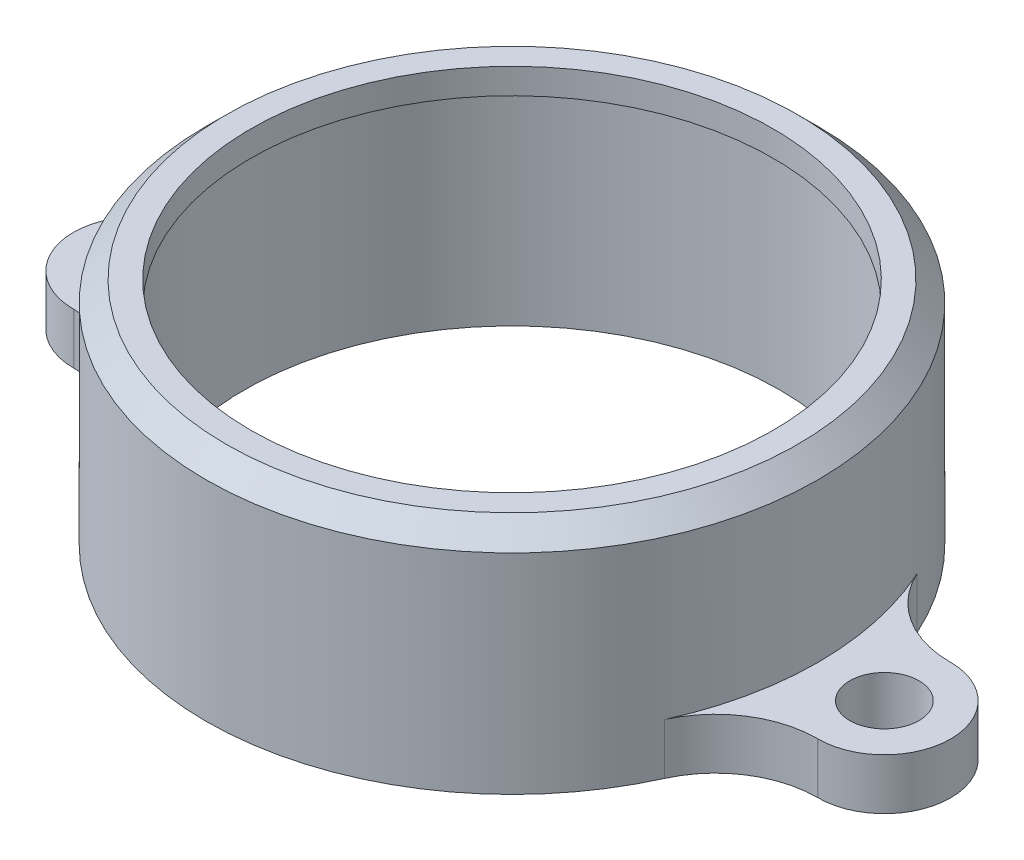
ISO-10303-21;
HEADER;
FILE_DESCRIPTION(('STEP AP214'),'2;1');
FILE_NAME('part.step','',(''),(''),'','','');
FILE_SCHEMA(('AUTOMOTIVE_DESIGN { 1 0 10303 214 1 1 1 1 }'));
ENDSEC;
DATA;
#1=APPLICATION_CONTEXT('core data for automotive mechanical design processes');
#2=APPLICATION_PROTOCOL_DEFINITION('international standard','automotive_design',2000,#1);
#3=PRODUCT_CONTEXT('',#1,'mechanical');
#4=PRODUCT('Part','Part','',(#3));
#5=PRODUCT_RELATED_PRODUCT_CATEGORY('part','',(#4));
#6=PRODUCT_DEFINITION_FORMATION('','',#4);
#7=PRODUCT_DEFINITION_CONTEXT('part definition',#1,'design');
#8=PRODUCT_DEFINITION('design','',#6,#7);
#9=PRODUCT_DEFINITION_SHAPE('','',#8);
#10=(LENGTH_UNIT() NAMED_UNIT(*) SI_UNIT(.MILLI.,.METRE.));
#11=(NAMED_UNIT(*) PLANE_ANGLE_UNIT() SI_UNIT($,.RADIAN.));
#12=(NAMED_UNIT(*) SI_UNIT($,.STERADIAN.) SOLID_ANGLE_UNIT());
#13=UNCERTAINTY_MEASURE_WITH_UNIT(LENGTH_MEASURE(1.E-05),#10,'distance_accuracy_value','');
#14=(GEOMETRIC_REPRESENTATION_CONTEXT(3) GLOBAL_UNCERTAINTY_ASSIGNED_CONTEXT((#13)) GLOBAL_UNIT_ASSIGNED_CONTEXT((#10,
#11,#12)) REPRESENTATION_CONTEXT('',''));
#15=CARTESIAN_POINT('',(0.,0.,0.));
#16=DIRECTION('',(0.,0.,1.));
#17=DIRECTION('',(1.,0.,0.));
#18=AXIS2_PLACEMENT_3D('',#15,#16,#17);
#19=CARTESIAN_POINT('',(0.,-1.5875,0.));
#20=DIRECTION('',(0.,1.,0.));
#21=DIRECTION('',(0.,0.,1.));
#22=AXIS2_PLACEMENT_3D('',#19,#20,#21);
#23=PLANE('',#22);
#24=CARTESIAN_POINT('',(0.,-1.5875,0.));
#25=DIRECTION('',(0.,1.,0.));
#26=DIRECTION('',(0.,0.,1.));
#27=AXIS2_PLACEMENT_3D('',#24,#25,#26);
#28=CIRCLE('',#27,16.256);
#29=CARTESIAN_POINT('',(0.,-1.5875,16.256));
#30=VERTEX_POINT('',#29);
#31=EDGE_CURVE('E213',#30,#30,#28,.T.);
#32=ORIENTED_EDGE('',*,*,#31,.T.);
#33=EDGE_LOOP('',(#32));
#34=FACE_BOUND('',#33,.T.);
#35=CARTESIAN_POINT('',(0.,-1.5875,0.));
#36=DIRECTION('',(0.,-1.,0.));
#37=DIRECTION('',(0.,0.,-1.));
#38=AXIS2_PLACEMENT_3D('',#35,#36,#37);
#39=CIRCLE('',#38,16.66875);
#40=CARTESIAN_POINT('',(0.,-1.5875,-16.66875));
#41=VERTEX_POINT('',#40);
#42=EDGE_CURVE('E155',#41,#41,#39,.T.);
#43=ORIENTED_EDGE('',*,*,#42,.T.);
#44=EDGE_LOOP('',(#43));
#45=FACE_BOUND('',#44,.T.);
#46=ADVANCED_FACE('F38',(#34,#45),#23,.F.);
#47=CARTESIAN_POINT('',(0.,-1.5875,0.));
#48=DIRECTION('',(0.,1.,0.));
#49=DIRECTION('',(0.,0.,1.));
#50=AXIS2_PLACEMENT_3D('',#47,#48,#49);
#51=CYLINDRICAL_SURFACE('',#50,19.05);
#52=CARTESIAN_POINT('',(0.,-1.27000000000001,0.));
#53=DIRECTION('',(0.,1.,0.));
#54=DIRECTION('',(0.,0.,1.));
#55=AXIS2_PLACEMENT_3D('',#52,#53,#54);
#56=CIRCLE('',#55,19.05);
#57=CARTESIAN_POINT('',(0.,-1.27000000000001,19.05));
#58=VERTEX_POINT('',#57);
#59=EDGE_CURVE('E224',#58,#58,#56,.F.);
#60=ORIENTED_EDGE('',*,*,#59,.T.);
#61=EDGE_LOOP('',(#60));
#62=FACE_BOUND('',#61,.T.);
#63=CARTESIAN_POINT('',(0.,-14.2875,0.));
#64=DIRECTION('',(0.,-1.,0.));
#65=DIRECTION('',(0.,0.,-1.));
#66=AXIS2_PLACEMENT_3D('',#63,#64,#65);
#67=CIRCLE('',#66,19.05);
#68=CARTESIAN_POINT('',(-17.3537422904795,-14.2875,-7.858125));
#69=VERTEX_POINT('',#68);
#70=CARTESIAN_POINT('',(17.3537422904795,-14.2875,-7.858125));
#71=VERTEX_POINT('',#70);
#72=EDGE_CURVE('E163',#69,#71,#67,.T.);
#73=ORIENTED_EDGE('',*,*,#72,.F.);
#74=DIRECTION('',(0.,1.,0.));
#75=VECTOR('',#74,1.);
#76=CARTESIAN_POINT('',(-17.3537422904795,-1.5875,-7.858125));
#77=LINE('',#76,#75);
#78=CARTESIAN_POINT('',(-17.3537422904795,-11.1125,-7.858125));
#79=VERTEX_POINT('',#78);
#80=EDGE_CURVE('E237',#69,#79,#77,.T.);
#81=ORIENTED_EDGE('',*,*,#80,.T.);
#82=CARTESIAN_POINT('',(0.,-11.1125,0.));
#83=DIRECTION('',(0.,-1.,0.));
#84=DIRECTION('',(0.,0.,-1.));
#85=AXIS2_PLACEMENT_3D('',#82,#83,#84);
#86=CIRCLE('',#85,19.05);
#87=CARTESIAN_POINT('',(-17.3537422904795,-11.1125,7.858125));
#88=VERTEX_POINT('',#87);
#89=EDGE_CURVE('E209',#88,#79,#86,.T.);
#90=ORIENTED_EDGE('',*,*,#89,.F.);
#91=DIRECTION('',(0.,1.,0.));
#92=VECTOR('',#91,1.);
#93=CARTESIAN_POINT('',(-17.3537422904795,-1.5875,7.858125));
#94=LINE('',#93,#92);
#95=CARTESIAN_POINT('',(-17.3537422904795,-14.2875,7.858125));
#96=VERTEX_POINT('',#95);
#97=EDGE_CURVE('E228',#88,#96,#94,.F.);
#98=ORIENTED_EDGE('',*,*,#97,.T.);
#99=CARTESIAN_POINT('',(0.,-14.2875,0.));
#100=DIRECTION('',(0.,-1.,0.));
#101=DIRECTION('',(0.,0.,-1.));
#102=AXIS2_PLACEMENT_3D('',#99,#100,#101);
#103=CIRCLE('',#102,19.05);
#104=CARTESIAN_POINT('',(17.3537422904795,-14.2875,7.858125));
#105=VERTEX_POINT('',#104);
#106=EDGE_CURVE('E146',#105,#96,#103,.T.);
#107=ORIENTED_EDGE('',*,*,#106,.F.);
#108=DIRECTION('',(0.,1.,0.));
#109=VECTOR('',#108,1.);
#110=CARTESIAN_POINT('',(17.3537422904795,-1.5875,7.858125));
#111=LINE('',#110,#109);
#112=CARTESIAN_POINT('',(17.3537422904795,-11.1125,7.858125));
#113=VERTEX_POINT('',#112);
#114=EDGE_CURVE('E230',#105,#113,#111,.T.);
#115=ORIENTED_EDGE('',*,*,#114,.T.);
#116=CARTESIAN_POINT('',(17.3537422904795,-11.1125,-7.858125));
#117=VERTEX_POINT('',#116);
#118=EDGE_CURVE('E205',#117,#113,#86,.T.);
#119=ORIENTED_EDGE('',*,*,#118,.F.);
#120=DIRECTION('',(0.,1.,0.));
#121=VECTOR('',#120,1.);
#122=CARTESIAN_POINT('',(17.3537422904795,-1.5875,-7.858125));
#123=LINE('',#122,#121);
#124=EDGE_CURVE('E234',#117,#71,#123,.F.);
#125=ORIENTED_EDGE('',*,*,#124,.T.);
#126=EDGE_LOOP('',(#73,#81,#90,#98,#107,#115,#119,#125));
#127=FACE_BOUND('',#126,.T.);
#128=ADVANCED_FACE('F273',(#62,#127),#51,.T.);
#129=CARTESIAN_POINT('',(0.,0.,0.));
#130=DIRECTION('',(0.,1.,0.));
#131=DIRECTION('',(0.,0.,1.));
#132=AXIS2_PLACEMENT_3D('',#129,#130,#131);
#133=PLANE('',#132);
#134=CARTESIAN_POINT('',(0.,0.,0.));
#135=DIRECTION('',(0.,1.,0.));
#136=DIRECTION('',(0.,0.,1.));
#137=AXIS2_PLACEMENT_3D('',#134,#135,#136);
#138=CIRCLE('',#137,17.78);
#139=CARTESIAN_POINT('',(0.,0.,17.78));
#140=VERTEX_POINT('',#139);
#141=EDGE_CURVE('E217',#140,#140,#138,.T.);
#142=ORIENTED_EDGE('',*,*,#141,.T.);
#143=EDGE_LOOP('',(#142));
#144=FACE_BOUND('',#143,.T.);
#145=CARTESIAN_POINT('',(0.,0.,0.));
#146=DIRECTION('',(0.,1.,0.));
#147=DIRECTION('',(0.,0.,1.));
#148=AXIS2_PLACEMENT_3D('',#145,#146,#147);
#149=CIRCLE('',#148,16.256);
#150=CARTESIAN_POINT('',(0.,0.,16.256));
#151=VERTEX_POINT('',#150);
#152=EDGE_CURVE('E208',#151,#151,#149,.T.);
#153=ORIENTED_EDGE('',*,*,#152,.F.);
#154=EDGE_LOOP('',(#153));
#155=FACE_BOUND('',#154,.T.);
#156=ADVANCED_FACE('F321',(#144,#155),#133,.T.);
#157=CARTESIAN_POINT('',(0.,-1.5875,0.));
#158=DIRECTION('',(0.,1.,0.));
#159=DIRECTION('',(0.,0.,1.));
#160=AXIS2_PLACEMENT_3D('',#157,#158,#159);
#161=CYLINDRICAL_SURFACE('',#160,16.256);
#162=ORIENTED_EDGE('',*,*,#31,.F.);
#163=EDGE_LOOP('',(#162));
#164=FACE_BOUND('',#163,.T.);
#165=ORIENTED_EDGE('',*,*,#152,.T.);
#166=EDGE_LOOP('',(#165));
#167=FACE_BOUND('',#166,.T.);
#168=ADVANCED_FACE('F327',(#164,#167),#161,.F.);
#169=CARTESIAN_POINT('',(0.,-64.9940367264149,0.));
#170=DIRECTION('',(0.,1.,0.));
#171=DIRECTION('',(0.,0.,1.));
#172=AXIS2_PLACEMENT_3D('',#169,#170,#171);
#173=CYLINDRICAL_SURFACE('',#172,16.66875);
#174=ORIENTED_EDGE('',*,*,#42,.F.);
#175=EDGE_LOOP('',(#174));
#176=FACE_BOUND('',#175,.T.);
#177=CARTESIAN_POINT('',(0.,-14.2875,0.));
#178=DIRECTION('',(0.,-1.,0.));
#179=DIRECTION('',(0.,0.,-1.));
#180=AXIS2_PLACEMENT_3D('',#177,#178,#179);
#181=CIRCLE('',#180,16.66875);
#182=CARTESIAN_POINT('',(0.,-14.2875,-16.66875));
#183=VERTEX_POINT('',#182);
#184=EDGE_CURVE('E182',#183,#183,#181,.T.);
#185=ORIENTED_EDGE('',*,*,#184,.T.);
#186=EDGE_LOOP('',(#185));
#187=FACE_BOUND('',#186,.T.);
#188=ADVANCED_FACE('F336',(#176,#187),#173,.F.);
#189=CARTESIAN_POINT('',(0.,0.,0.));
#190=DIRECTION('',(0.,-1.,0.));
#191=DIRECTION('',(0.,0.,-1.));
#192=AXIS2_PLACEMENT_3D('',#189,#190,#191);
#193=CONICAL_SURFACE('',#192,17.78,0.785398163397447);
#194=ORIENTED_EDGE('',*,*,#59,.F.);
#195=EDGE_LOOP('',(#194));
#196=FACE_BOUND('',#195,.T.);
#197=ORIENTED_EDGE('',*,*,#141,.F.);
#198=EDGE_LOOP('',(#197));
#199=FACE_BOUND('',#198,.T.);
#200=ADVANCED_FACE('F332',(#196,#199),#193,.T.);
#201=CARTESIAN_POINT('',(0.,-11.1125,0.));
#202=DIRECTION('',(0.,-1.,0.));
#203=DIRECTION('',(0.,0.,-1.));
#204=AXIS2_PLACEMENT_3D('',#201,#202,#203);
#205=PLANE('',#204);
#206=CARTESIAN_POINT('',(23.1775,-11.1125,0.));
#207=DIRECTION('',(0.,-1.,0.));
#208=DIRECTION('',(0.,0.,-1.));
#209=AXIS2_PLACEMENT_3D('',#206,#207,#208);
#210=CIRCLE('',#209,2.15264999999999);
#211=CARTESIAN_POINT('',(23.1775,-11.1125,-2.15264999999999));
#212=VERTEX_POINT('',#211);
#213=EDGE_CURVE('E287',#212,#212,#210,.T.);
#214=ORIENTED_EDGE('',*,*,#213,.T.);
#215=EDGE_LOOP('',(#214));
#216=FACE_BOUND('',#215,.T.);
#217=DIRECTION('',(1.,0.,0.));
#218=VECTOR('',#217,1.);
#219=CARTESIAN_POINT('',(23.1775,-11.1125,-4.1275));
#220=LINE('',#219,#218);
#221=CARTESIAN_POINT('',(23.1383230539726,-11.1125,-4.1275));
#222=VERTEX_POINT('',#221);
#223=CARTESIAN_POINT('',(23.1775,-11.1125,-4.1275));
#224=VERTEX_POINT('',#223);
#225=EDGE_CURVE('E187',#222,#224,#220,.T.);
#226=ORIENTED_EDGE('',*,*,#225,.F.);
#227=CARTESIAN_POINT('',(23.1383230539726,-11.1125,-10.4775));
#228=DIRECTION('',(0.,-1.,0.));
#229=DIRECTION('',(0.,0.,-1.));
#230=AXIS2_PLACEMENT_3D('',#227,#228,#229);
#231=CIRCLE('',#230,6.35);
#232=EDGE_CURVE('E255',#222,#117,#231,.T.);
#233=ORIENTED_EDGE('',*,*,#232,.T.);
#234=ORIENTED_EDGE('',*,*,#118,.T.);
#235=CARTESIAN_POINT('',(23.1383230539726,-11.1125,10.4775));
#236=DIRECTION('',(0.,-1.,0.));
#237=DIRECTION('',(0.,0.,-1.));
#238=AXIS2_PLACEMENT_3D('',#235,#236,#237);
#239=CIRCLE('',#238,6.35);
#240=CARTESIAN_POINT('',(23.1383230539726,-11.1125,4.1275));
#241=VERTEX_POINT('',#240);
#242=EDGE_CURVE('E262',#113,#241,#239,.T.);
#243=ORIENTED_EDGE('',*,*,#242,.T.);
#244=DIRECTION('',(-1.,0.,0.));
#245=VECTOR('',#244,1.);
#246=CARTESIAN_POINT('',(23.1775,-11.1125,4.1275));
#247=LINE('',#246,#245);
#248=CARTESIAN_POINT('',(23.1775,-11.1125,4.1275));
#249=VERTEX_POINT('',#248);
#250=EDGE_CURVE('E193',#249,#241,#247,.T.);
#251=ORIENTED_EDGE('',*,*,#250,.F.);
#252=CARTESIAN_POINT('',(23.1775,-11.1125,0.));
#253=DIRECTION('',(0.,-1.,0.));
#254=DIRECTION('',(0.,0.,1.));
#255=AXIS2_PLACEMENT_3D('',#252,#253,#254);
#256=CIRCLE('',#255,4.1275);
#257=EDGE_CURVE('E190',#224,#249,#256,.T.);
#258=ORIENTED_EDGE('',*,*,#257,.F.);
#259=EDGE_LOOP('',(#226,#233,#234,#243,#251,#258));
#260=FACE_BOUND('',#259,.T.);
#261=ADVANCED_FACE('F335',(#216,#260),#205,.F.);
#262=CARTESIAN_POINT('',(-23.1775,-11.1125,0.));
#263=DIRECTION('',(0.,-1.,0.));
#264=DIRECTION('',(0.,0.,-1.));
#265=AXIS2_PLACEMENT_3D('',#262,#263,#264);
#266=CIRCLE('',#265,2.15264999999999);
#267=CARTESIAN_POINT('',(-23.1775,-11.1125,-2.15264999999999));
#268=VERTEX_POINT('',#267);
#269=EDGE_CURVE('E281',#268,#268,#266,.T.);
#270=ORIENTED_EDGE('',*,*,#269,.T.);
#271=EDGE_LOOP('',(#270));
#272=FACE_BOUND('',#271,.T.);
#273=DIRECTION('',(-1.,0.,0.));
#274=VECTOR('',#273,1.);
#275=CARTESIAN_POINT('',(-23.1775,-11.1125,4.1275));
#276=LINE('',#275,#274);
#277=CARTESIAN_POINT('',(-23.1383230539726,-11.1125,4.1275));
#278=VERTEX_POINT('',#277);
#279=CARTESIAN_POINT('',(-23.1775,-11.1125,4.1275));
#280=VERTEX_POINT('',#279);
#281=EDGE_CURVE('E152',#278,#280,#276,.T.);
#282=ORIENTED_EDGE('',*,*,#281,.F.);
#283=CARTESIAN_POINT('',(-23.1383230539726,-11.1125,10.4775));
#284=DIRECTION('',(0.,-1.,0.));
#285=DIRECTION('',(0.,0.,-1.));
#286=AXIS2_PLACEMENT_3D('',#283,#284,#285);
#287=CIRCLE('',#286,6.35);
#288=EDGE_CURVE('E46',#278,#88,#287,.T.);
#289=ORIENTED_EDGE('',*,*,#288,.T.);
#290=ORIENTED_EDGE('',*,*,#89,.T.);
#291=CARTESIAN_POINT('',(-23.1383230539726,-11.1125,-10.4775));
#292=DIRECTION('',(0.,-1.,0.));
#293=DIRECTION('',(0.,0.,-1.));
#294=AXIS2_PLACEMENT_3D('',#291,#292,#293);
#295=CIRCLE('',#294,6.35);
#296=CARTESIAN_POINT('',(-23.1383230539726,-11.1125,-4.1275));
#297=VERTEX_POINT('',#296);
#298=EDGE_CURVE('E251',#79,#297,#295,.T.);
#299=ORIENTED_EDGE('',*,*,#298,.T.);
#300=DIRECTION('',(1.,0.,0.));
#301=VECTOR('',#300,1.);
#302=CARTESIAN_POINT('',(-23.1775,-11.1125,-4.1275));
#303=LINE('',#302,#301);
#304=CARTESIAN_POINT('',(-23.1775,-11.1125,-4.1275));
#305=VERTEX_POINT('',#304);
#306=EDGE_CURVE('E184',#305,#297,#303,.T.);
#307=ORIENTED_EDGE('',*,*,#306,.F.);
#308=CARTESIAN_POINT('',(-23.1775,-11.1125,0.));
#309=DIRECTION('',(0.,-1.,0.));
#310=DIRECTION('',(0.,0.,-1.));
#311=AXIS2_PLACEMENT_3D('',#308,#309,#310);
#312=CIRCLE('',#311,4.1275);
#313=EDGE_CURVE('E181',#280,#305,#312,.T.);
#314=ORIENTED_EDGE('',*,*,#313,.F.);
#315=EDGE_LOOP('',(#282,#289,#290,#299,#307,#314));
#316=FACE_BOUND('',#315,.T.);
#317=ADVANCED_FACE('F268',(#272,#316),#205,.F.);
#318=CARTESIAN_POINT('',(0.,-14.2875,0.));
#319=DIRECTION('',(0.,-1.,0.));
#320=DIRECTION('',(0.,0.,-1.));
#321=AXIS2_PLACEMENT_3D('',#318,#319,#320);
#322=PLANE('',#321);
#323=CARTESIAN_POINT('',(23.1775,-14.2875,0.));
#324=DIRECTION('',(0.,-1.,0.));
#325=DIRECTION('',(0.,0.,-1.));
#326=AXIS2_PLACEMENT_3D('',#323,#324,#325);
#327=CIRCLE('',#326,2.15264999999999);
#328=CARTESIAN_POINT('',(23.1775,-14.2875,-2.15264999999999));
#329=VERTEX_POINT('',#328);
#330=EDGE_CURVE('E291',#329,#329,#327,.T.);
#331=ORIENTED_EDGE('',*,*,#330,.F.);
#332=EDGE_LOOP('',(#331));
#333=FACE_BOUND('',#332,.T.);
#334=CARTESIAN_POINT('',(-23.1775,-14.2875,0.));
#335=DIRECTION('',(0.,-1.,0.));
#336=DIRECTION('',(0.,0.,-1.));
#337=AXIS2_PLACEMENT_3D('',#334,#335,#336);
#338=CIRCLE('',#337,2.15264999999999);
#339=CARTESIAN_POINT('',(-23.1775,-14.2875,-2.15264999999999));
#340=VERTEX_POINT('',#339);
#341=EDGE_CURVE('E284',#340,#340,#338,.T.);
#342=ORIENTED_EDGE('',*,*,#341,.F.);
#343=EDGE_LOOP('',(#342));
#344=FACE_BOUND('',#343,.T.);
#345=DIRECTION('',(-1.,0.,0.));
#346=VECTOR('',#345,1.);
#347=CARTESIAN_POINT('',(23.1775,-14.2875,4.1275));
#348=LINE('',#347,#346);
#349=CARTESIAN_POINT('',(23.1775,-14.2875,4.1275));
#350=VERTEX_POINT('',#349);
#351=CARTESIAN_POINT('',(23.1383230539726,-14.2875,4.1275));
#352=VERTEX_POINT('',#351);
#353=EDGE_CURVE('E176',#350,#352,#348,.T.);
#354=ORIENTED_EDGE('',*,*,#353,.T.);
#355=CARTESIAN_POINT('',(23.1383230539726,-14.2875,10.4775));
#356=DIRECTION('',(0.,-1.,0.));
#357=DIRECTION('',(0.,0.,-1.));
#358=AXIS2_PLACEMENT_3D('',#355,#356,#357);
#359=CIRCLE('',#358,6.35);
#360=EDGE_CURVE('E265',#352,#105,#359,.F.);
#361=ORIENTED_EDGE('',*,*,#360,.T.);
#362=ORIENTED_EDGE('',*,*,#106,.T.);
#363=CARTESIAN_POINT('',(-23.1383230539726,-14.2875,10.4775));
#364=DIRECTION('',(0.,-1.,0.));
#365=DIRECTION('',(0.,0.,-1.));
#366=AXIS2_PLACEMENT_3D('',#363,#364,#365);
#367=CIRCLE('',#366,6.35);
#368=CARTESIAN_POINT('',(-23.1383230539726,-14.2875,4.1275));
#369=VERTEX_POINT('',#368);
#370=EDGE_CURVE('E11',#96,#369,#367,.F.);
#371=ORIENTED_EDGE('',*,*,#370,.T.);
#372=DIRECTION('',(-1.,0.,0.));
#373=VECTOR('',#372,1.);
#374=CARTESIAN_POINT('',(-23.1775,-14.2875,4.1275));
#375=LINE('',#374,#373);
#376=CARTESIAN_POINT('',(-23.1775,-14.2875,4.1275));
#377=VERTEX_POINT('',#376);
#378=EDGE_CURVE('E136',#369,#377,#375,.T.);
#379=ORIENTED_EDGE('',*,*,#378,.T.);
#380=CARTESIAN_POINT('',(-23.1775,-14.2875,0.));
#381=DIRECTION('',(0.,-1.,0.));
#382=DIRECTION('',(0.,0.,-1.));
#383=AXIS2_PLACEMENT_3D('',#380,#381,#382);
#384=CIRCLE('',#383,4.1275);
#385=CARTESIAN_POINT('',(-23.1775,-14.2875,-4.1275));
#386=VERTEX_POINT('',#385);
#387=EDGE_CURVE('E143',#377,#386,#384,.T.);
#388=ORIENTED_EDGE('',*,*,#387,.T.);
#389=DIRECTION('',(1.,0.,0.));
#390=VECTOR('',#389,1.);
#391=CARTESIAN_POINT('',(-23.1775,-14.2875,-4.1275));
#392=LINE('',#391,#390);
#393=CARTESIAN_POINT('',(-23.1383230539726,-14.2875,-4.1275));
#394=VERTEX_POINT('',#393);
#395=EDGE_CURVE('E161',#386,#394,#392,.T.);
#396=ORIENTED_EDGE('',*,*,#395,.T.);
#397=CARTESIAN_POINT('',(-23.1383230539726,-14.2875,-10.4775));
#398=DIRECTION('',(0.,-1.,0.));
#399=DIRECTION('',(0.,0.,-1.));
#400=AXIS2_PLACEMENT_3D('',#397,#398,#399);
#401=CIRCLE('',#400,6.35);
#402=EDGE_CURVE('E253',#394,#69,#401,.F.);
#403=ORIENTED_EDGE('',*,*,#402,.T.);
#404=ORIENTED_EDGE('',*,*,#72,.T.);
#405=CARTESIAN_POINT('',(23.1383230539726,-14.2875,-10.4775));
#406=DIRECTION('',(0.,-1.,0.));
#407=DIRECTION('',(0.,0.,-1.));
#408=AXIS2_PLACEMENT_3D('',#405,#406,#407);
#409=CIRCLE('',#408,6.35);
#410=CARTESIAN_POINT('',(23.1383230539726,-14.2875,-4.1275));
#411=VERTEX_POINT('',#410);
#412=EDGE_CURVE('E259',#71,#411,#409,.F.);
#413=ORIENTED_EDGE('',*,*,#412,.T.);
#414=DIRECTION('',(1.,0.,0.));
#415=VECTOR('',#414,1.);
#416=CARTESIAN_POINT('',(23.1775,-14.2875,-4.1275));
#417=LINE('',#416,#415);
#418=CARTESIAN_POINT('',(23.1775,-14.2875,-4.1275));
#419=VERTEX_POINT('',#418);
#420=EDGE_CURVE('E170',#411,#419,#417,.T.);
#421=ORIENTED_EDGE('',*,*,#420,.T.);
#422=CARTESIAN_POINT('',(23.1775,-14.2875,0.));
#423=DIRECTION('',(0.,-1.,0.));
#424=DIRECTION('',(0.,0.,1.));
#425=AXIS2_PLACEMENT_3D('',#422,#423,#424);
#426=CIRCLE('',#425,4.1275);
#427=EDGE_CURVE('E173',#419,#350,#426,.T.);
#428=ORIENTED_EDGE('',*,*,#427,.T.);
#429=EDGE_LOOP('',(#354,#361,#362,#371,#379,#388,#396,#403,#404,#413,#421,#428));
#430=FACE_BOUND('',#429,.T.);
#431=ORIENTED_EDGE('',*,*,#184,.F.);
#432=EDGE_LOOP('',(#431));
#433=FACE_BOUND('',#432,.T.);
#434=ADVANCED_FACE('F139',(#333,#344,#430,#433),#322,.T.);
#435=CARTESIAN_POINT('',(-23.1775,-14.2875,4.1275));
#436=DIRECTION('',(0.,0.,-1.));
#437=DIRECTION('',(-1.,0.,0.));
#438=AXIS2_PLACEMENT_3D('',#435,#436,#437);
#439=PLANE('',#438);
#440=ORIENTED_EDGE('',*,*,#378,.F.);
#441=DIRECTION('',(0.,1.,0.));
#442=VECTOR('',#441,1.);
#443=CARTESIAN_POINT('',(-23.1383230539726,-14.2875,4.1275));
#444=LINE('',#443,#442);
#445=EDGE_CURVE('E249',#369,#278,#444,.T.);
#446=ORIENTED_EDGE('',*,*,#445,.T.);
#447=ORIENTED_EDGE('',*,*,#281,.T.);
#448=DIRECTION('',(0.,1.,0.));
#449=VECTOR('',#448,1.);
#450=CARTESIAN_POINT('',(-23.1775,-14.2875,4.1275));
#451=LINE('',#450,#449);
#452=EDGE_CURVE('E149',#377,#280,#451,.T.);
#453=ORIENTED_EDGE('',*,*,#452,.F.);
#454=EDGE_LOOP('',(#440,#446,#447,#453));
#455=FACE_BOUND('',#454,.T.);
#456=ADVANCED_FACE('F150',(#455),#439,.F.);
#457=CARTESIAN_POINT('',(-23.1775,-14.2875,0.));
#458=DIRECTION('',(0.,1.,0.));
#459=DIRECTION('',(0.,0.,1.));
#460=AXIS2_PLACEMENT_3D('',#457,#458,#459);
#461=CYLINDRICAL_SURFACE('',#460,4.1275);
#462=ORIENTED_EDGE('',*,*,#313,.T.);
#463=DIRECTION('',(0.,1.,0.));
#464=VECTOR('',#463,1.);
#465=CARTESIAN_POINT('',(-23.1775,-14.2875,-4.1275));
#466=LINE('',#465,#464);
#467=EDGE_CURVE('E156',#386,#305,#466,.T.);
#468=ORIENTED_EDGE('',*,*,#467,.F.);
#469=ORIENTED_EDGE('',*,*,#387,.F.);
#470=ORIENTED_EDGE('',*,*,#452,.T.);
#471=EDGE_LOOP('',(#462,#468,#469,#470));
#472=FACE_BOUND('',#471,.T.);
#473=ADVANCED_FACE('F158',(#472),#461,.T.);
#474=CARTESIAN_POINT('',(-23.1775,-14.2875,-4.1275));
#475=DIRECTION('',(0.,0.,1.));
#476=DIRECTION('',(1.,0.,0.));
#477=AXIS2_PLACEMENT_3D('',#474,#475,#476);
#478=PLANE('',#477);
#479=ORIENTED_EDGE('',*,*,#306,.T.);
#480=DIRECTION('',(0.,1.,0.));
#481=VECTOR('',#480,1.);
#482=CARTESIAN_POINT('',(-23.1383230539726,-14.2875,-4.1275));
#483=LINE('',#482,#481);
#484=EDGE_CURVE('E240',#297,#394,#483,.F.);
#485=ORIENTED_EDGE('',*,*,#484,.T.);
#486=ORIENTED_EDGE('',*,*,#395,.F.);
#487=ORIENTED_EDGE('',*,*,#467,.T.);
#488=EDGE_LOOP('',(#479,#485,#486,#487));
#489=FACE_BOUND('',#488,.T.);
#490=ADVANCED_FACE('F379',(#489),#478,.F.);
#491=CARTESIAN_POINT('',(23.1775,-14.2875,-4.1275));
#492=DIRECTION('',(0.,0.,1.));
#493=DIRECTION('',(1.,0.,0.));
#494=AXIS2_PLACEMENT_3D('',#491,#492,#493);
#495=PLANE('',#494);
#496=ORIENTED_EDGE('',*,*,#420,.F.);
#497=DIRECTION('',(0.,1.,0.));
#498=VECTOR('',#497,1.);
#499=CARTESIAN_POINT('',(23.1383230539726,-14.2875,-4.1275));
#500=LINE('',#499,#498);
#501=EDGE_CURVE('E242',#411,#222,#500,.T.);
#502=ORIENTED_EDGE('',*,*,#501,.T.);
#503=ORIENTED_EDGE('',*,*,#225,.T.);
#504=DIRECTION('',(0.,1.,0.));
#505=VECTOR('',#504,1.);
#506=CARTESIAN_POINT('',(23.1775,-14.2875,-4.1275));
#507=LINE('',#506,#505);
#508=EDGE_CURVE('E200',#419,#224,#507,.T.);
#509=ORIENTED_EDGE('',*,*,#508,.F.);
#510=EDGE_LOOP('',(#496,#502,#503,#509));
#511=FACE_BOUND('',#510,.T.);
#512=ADVANCED_FACE('F361',(#511),#495,.F.);
#513=CARTESIAN_POINT('',(23.1775,-14.2875,0.));
#514=DIRECTION('',(0.,1.,0.));
#515=DIRECTION('',(0.,0.,1.));
#516=AXIS2_PLACEMENT_3D('',#513,#514,#515);
#517=CYLINDRICAL_SURFACE('',#516,4.1275);
#518=ORIENTED_EDGE('',*,*,#257,.T.);
#519=DIRECTION('',(0.,1.,0.));
#520=VECTOR('',#519,1.);
#521=CARTESIAN_POINT('',(23.1775,-14.2875,4.1275));
#522=LINE('',#521,#520);
#523=EDGE_CURVE('E179',#350,#249,#522,.T.);
#524=ORIENTED_EDGE('',*,*,#523,.F.);
#525=ORIENTED_EDGE('',*,*,#427,.F.);
#526=ORIENTED_EDGE('',*,*,#508,.T.);
#527=EDGE_LOOP('',(#518,#524,#525,#526));
#528=FACE_BOUND('',#527,.T.);
#529=ADVANCED_FACE('F365',(#528),#517,.T.);
#530=CARTESIAN_POINT('',(23.1775,-14.2875,4.1275));
#531=DIRECTION('',(0.,0.,-1.));
#532=DIRECTION('',(-1.,0.,0.));
#533=AXIS2_PLACEMENT_3D('',#530,#531,#532);
#534=PLANE('',#533);
#535=ORIENTED_EDGE('',*,*,#250,.T.);
#536=DIRECTION('',(0.,1.,0.));
#537=VECTOR('',#536,1.);
#538=CARTESIAN_POINT('',(23.1383230539726,-14.2875,4.1275));
#539=LINE('',#538,#537);
#540=EDGE_CURVE('E246',#241,#352,#539,.F.);
#541=ORIENTED_EDGE('',*,*,#540,.T.);
#542=ORIENTED_EDGE('',*,*,#353,.F.);
#543=ORIENTED_EDGE('',*,*,#523,.T.);
#544=EDGE_LOOP('',(#535,#541,#542,#543));
#545=FACE_BOUND('',#544,.T.);
#546=ADVANCED_FACE('F342',(#545),#534,.F.);
#547=CARTESIAN_POINT('',(-23.1383230539726,-1.5875,-10.4775));
#548=DIRECTION('',(0.,1.,0.));
#549=DIRECTION('',(0.,0.,1.));
#550=AXIS2_PLACEMENT_3D('',#547,#548,#549);
#551=CYLINDRICAL_SURFACE('',#550,6.35);
#552=ORIENTED_EDGE('',*,*,#402,.F.);
#553=ORIENTED_EDGE('',*,*,#484,.F.);
#554=ORIENTED_EDGE('',*,*,#298,.F.);
#555=ORIENTED_EDGE('',*,*,#80,.F.);
#556=EDGE_LOOP('',(#552,#553,#554,#555));
#557=FACE_BOUND('',#556,.T.);
#558=ADVANCED_FACE('F338',(#557),#551,.F.);
#559=CARTESIAN_POINT('',(23.1383230539726,-1.5875,-10.4775));
#560=DIRECTION('',(0.,1.,0.));
#561=DIRECTION('',(0.,0.,1.));
#562=AXIS2_PLACEMENT_3D('',#559,#560,#561);
#563=CYLINDRICAL_SURFACE('',#562,6.35);
#564=ORIENTED_EDGE('',*,*,#412,.F.);
#565=ORIENTED_EDGE('',*,*,#124,.F.);
#566=ORIENTED_EDGE('',*,*,#232,.F.);
#567=ORIENTED_EDGE('',*,*,#501,.F.);
#568=EDGE_LOOP('',(#564,#565,#566,#567));
#569=FACE_BOUND('',#568,.T.);
#570=ADVANCED_FACE('F341',(#569),#563,.F.);
#571=CARTESIAN_POINT('',(23.1383230539726,-1.5875,10.4775));
#572=DIRECTION('',(0.,1.,0.));
#573=DIRECTION('',(0.,0.,1.));
#574=AXIS2_PLACEMENT_3D('',#571,#572,#573);
#575=CYLINDRICAL_SURFACE('',#574,6.35);
#576=ORIENTED_EDGE('',*,*,#360,.F.);
#577=ORIENTED_EDGE('',*,*,#540,.F.);
#578=ORIENTED_EDGE('',*,*,#242,.F.);
#579=ORIENTED_EDGE('',*,*,#114,.F.);
#580=EDGE_LOOP('',(#576,#577,#578,#579));
#581=FACE_BOUND('',#580,.T.);
#582=ADVANCED_FACE('F313',(#581),#575,.F.);
#583=CARTESIAN_POINT('',(-23.1383230539726,-1.5875,10.4775));
#584=DIRECTION('',(0.,1.,0.));
#585=DIRECTION('',(0.,0.,1.));
#586=AXIS2_PLACEMENT_3D('',#583,#584,#585);
#587=CYLINDRICAL_SURFACE('',#586,6.35);
#588=ORIENTED_EDGE('',*,*,#370,.F.);
#589=ORIENTED_EDGE('',*,*,#97,.F.);
#590=ORIENTED_EDGE('',*,*,#288,.F.);
#591=ORIENTED_EDGE('',*,*,#445,.F.);
#592=EDGE_LOOP('',(#588,#589,#590,#591));
#593=FACE_BOUND('',#592,.T.);
#594=ADVANCED_FACE('F40',(#593),#587,.F.);
#595=CARTESIAN_POINT('',(-23.1775,-14.2875,0.));
#596=DIRECTION('',(0.,-1.,0.));
#597=DIRECTION('',(0.,0.,-1.));
#598=AXIS2_PLACEMENT_3D('',#595,#596,#597);
#599=CYLINDRICAL_SURFACE('',#598,2.15264999999999);
#600=ORIENTED_EDGE('',*,*,#269,.F.);
#601=EDGE_LOOP('',(#600));
#602=FACE_BOUND('',#601,.T.);
#603=ORIENTED_EDGE('',*,*,#341,.T.);
#604=EDGE_LOOP('',(#603));
#605=FACE_BOUND('',#604,.T.);
#606=ADVANCED_FACE('F303',(#602,#605),#599,.F.);
#607=CARTESIAN_POINT('',(23.1775,-14.2875,0.));
#608=DIRECTION('',(0.,-1.,0.));
#609=DIRECTION('',(0.,0.,-1.));
#610=AXIS2_PLACEMENT_3D('',#607,#608,#609);
#611=CYLINDRICAL_SURFACE('',#610,2.15264999999999);
#612=ORIENTED_EDGE('',*,*,#213,.F.);
#613=EDGE_LOOP('',(#612));
#614=FACE_BOUND('',#613,.T.);
#615=ORIENTED_EDGE('',*,*,#330,.T.);
#616=EDGE_LOOP('',(#615));
#617=FACE_BOUND('',#616,.T.);
#618=ADVANCED_FACE('F296',(#614,#617),#611,.F.);
#619=CLOSED_SHELL('',(#46,#128,#156,#168,#188,#200,#261,#317,#434,#456,#473,#490,#512,#529,#546,
#558,#570,#582,#594,#606,#618));
#620=MANIFOLD_SOLID_BREP('B2',#619);
#621=ADVANCED_BREP_SHAPE_REPRESENTATION('',(#18,#620),#14);
#622=SHAPE_DEFINITION_REPRESENTATION(#9,#621);
ENDSEC;
END-ISO-10303-21;
